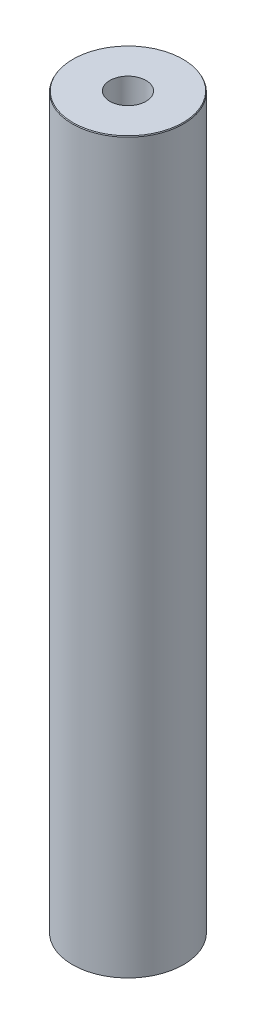
ISO-10303-21;
HEADER;
FILE_DESCRIPTION(('STEP AP214'),'2;1');
FILE_NAME('part.step','',(''),(''),'','','');
FILE_SCHEMA(('AUTOMOTIVE_DESIGN { 1 0 10303 214 1 1 1 1 }'));
ENDSEC;
DATA;
#1=APPLICATION_CONTEXT('core data for automotive mechanical design processes');
#2=APPLICATION_PROTOCOL_DEFINITION('international standard','automotive_design',2000,#1);
#3=PRODUCT_CONTEXT('',#1,'mechanical');
#4=PRODUCT('Part','Part','',(#3));
#5=PRODUCT_RELATED_PRODUCT_CATEGORY('part','',(#4));
#6=PRODUCT_DEFINITION_FORMATION('','',#4);
#7=PRODUCT_DEFINITION_CONTEXT('part definition',#1,'design');
#8=PRODUCT_DEFINITION('design','',#6,#7);
#9=PRODUCT_DEFINITION_SHAPE('','',#8);
#10=(LENGTH_UNIT() NAMED_UNIT(*) SI_UNIT(.MILLI.,.METRE.));
#11=(NAMED_UNIT(*) PLANE_ANGLE_UNIT() SI_UNIT($,.RADIAN.));
#12=(NAMED_UNIT(*) SI_UNIT($,.STERADIAN.) SOLID_ANGLE_UNIT());
#13=UNCERTAINTY_MEASURE_WITH_UNIT(LENGTH_MEASURE(1.E-05),#10,'distance_accuracy_value','');
#14=(GEOMETRIC_REPRESENTATION_CONTEXT(3) GLOBAL_UNCERTAINTY_ASSIGNED_CONTEXT((#13)) GLOBAL_UNIT_ASSIGNED_CONTEXT((#10,
#11,#12)) REPRESENTATION_CONTEXT('',''));
#15=CARTESIAN_POINT('',(0.,0.,0.));
#16=DIRECTION('',(0.,0.,1.));
#17=DIRECTION('',(1.,0.,0.));
#18=AXIS2_PLACEMENT_3D('',#15,#16,#17);
#19=CARTESIAN_POINT('',(0.,394.291483445102,0.));
#20=DIRECTION('',(0.,-1.,0.));
#21=DIRECTION('',(0.,0.,-1.));
#22=AXIS2_PLACEMENT_3D('',#19,#20,#21);
#23=CYLINDRICAL_SURFACE('',#22,30.);
#24=CARTESIAN_POINT('',(0.,393.805479076296,0.));
#25=DIRECTION('',(0.,1.,0.));
#26=DIRECTION('',(0.,0.,1.));
#27=AXIS2_PLACEMENT_3D('',#24,#25,#26);
#28=CIRCLE('',#27,30.);
#29=CARTESIAN_POINT('',(0.,393.805479076296,30.));
#30=VERTEX_POINT('',#29);
#31=EDGE_CURVE('E50',#30,#30,#28,.F.);
#32=ORIENTED_EDGE('',*,*,#31,.T.);
#33=EDGE_LOOP('',(#32));
#34=FACE_BOUND('',#33,.T.);
#35=CARTESIAN_POINT('',(0.,0.28059475315767,0.));
#36=DIRECTION('',(0.,1.,0.));
#37=DIRECTION('',(0.,0.,1.));
#38=AXIS2_PLACEMENT_3D('',#35,#36,#37);
#39=CIRCLE('',#38,30.);
#40=CARTESIAN_POINT('',(0.,0.28059475315767,30.));
#41=VERTEX_POINT('',#40);
#42=EDGE_CURVE('E51',#41,#41,#39,.T.);
#43=ORIENTED_EDGE('',*,*,#42,.T.);
#44=EDGE_LOOP('',(#43));
#45=FACE_BOUND('',#44,.T.);
#46=ADVANCED_FACE('F39',(#34,#45),#23,.T.);
#47=CARTESIAN_POINT('',(0.,394.291483445102,0.));
#48=DIRECTION('',(0.,1.,0.));
#49=DIRECTION('',(0.,0.,1.));
#50=AXIS2_PLACEMENT_3D('',#47,#48,#49);
#51=PLANE('',#50);
#52=CARTESIAN_POINT('',(0.,394.291483445102,0.));
#53=DIRECTION('',(0.,1.,0.));
#54=DIRECTION('',(0.,0.,1.));
#55=AXIS2_PLACEMENT_3D('',#52,#53,#54);
#56=CIRCLE('',#55,29.7194052468423);
#57=CARTESIAN_POINT('',(0.,394.291483445102,29.7194052468423));
#58=VERTEX_POINT('',#57);
#59=EDGE_CURVE('E54',#58,#58,#56,.T.);
#60=ORIENTED_EDGE('',*,*,#59,.T.);
#61=EDGE_LOOP('',(#60));
#62=FACE_BOUND('',#61,.T.);
#63=CARTESIAN_POINT('',(0.,394.291483445102,0.));
#64=DIRECTION('',(0.,1.,0.));
#65=DIRECTION('',(0.,0.,1.));
#66=AXIS2_PLACEMENT_3D('',#63,#64,#65);
#67=CIRCLE('',#66,9.78675789232819);
#68=CARTESIAN_POINT('',(0.,394.291483445102,9.78675789232819));
#69=VERTEX_POINT('',#68);
#70=EDGE_CURVE('E58',#69,#69,#67,.T.);
#71=ORIENTED_EDGE('',*,*,#70,.F.);
#72=EDGE_LOOP('',(#71));
#73=FACE_BOUND('',#72,.T.);
#74=ADVANCED_FACE('F69',(#62,#73),#51,.T.);
#75=CARTESIAN_POINT('',(0.,0.,0.));
#76=DIRECTION('',(0.,1.,0.));
#77=DIRECTION('',(0.,0.,1.));
#78=AXIS2_PLACEMENT_3D('',#75,#76,#77);
#79=PLANE('',#78);
#80=CARTESIAN_POINT('',(0.,0.,0.));
#81=DIRECTION('',(0.,1.,0.));
#82=DIRECTION('',(0.,0.,1.));
#83=AXIS2_PLACEMENT_3D('',#80,#81,#82);
#84=CIRCLE('',#83,29.5139956311936);
#85=CARTESIAN_POINT('',(0.,0.,29.5139956311936));
#86=VERTEX_POINT('',#85);
#87=EDGE_CURVE('E10',#86,#86,#84,.F.);
#88=ORIENTED_EDGE('',*,*,#87,.T.);
#89=EDGE_LOOP('',(#88));
#90=FACE_BOUND('',#89,.T.);
#91=CARTESIAN_POINT('',(0.,0.,0.));
#92=DIRECTION('',(0.,1.,0.));
#93=DIRECTION('',(0.,0.,1.));
#94=AXIS2_PLACEMENT_3D('',#91,#92,#93);
#95=CIRCLE('',#94,9.78675789232819);
#96=CARTESIAN_POINT('',(0.,0.,9.78675789232819));
#97=VERTEX_POINT('',#96);
#98=EDGE_CURVE('E63',#97,#97,#95,.T.);
#99=ORIENTED_EDGE('',*,*,#98,.T.);
#100=EDGE_LOOP('',(#99));
#101=FACE_BOUND('',#100,.T.);
#102=ADVANCED_FACE('F75',(#90,#101),#79,.F.);
#103=CARTESIAN_POINT('',(0.,394.291483445102,0.));
#104=DIRECTION('',(0.,-1.,0.));
#105=DIRECTION('',(0.,0.,-1.));
#106=AXIS2_PLACEMENT_3D('',#103,#104,#105);
#107=CYLINDRICAL_SURFACE('',#106,9.78675789232819);
#108=ORIENTED_EDGE('',*,*,#70,.T.);
#109=EDGE_LOOP('',(#108));
#110=FACE_BOUND('',#109,.T.);
#111=ORIENTED_EDGE('',*,*,#98,.F.);
#112=EDGE_LOOP('',(#111));
#113=FACE_BOUND('',#112,.T.);
#114=ADVANCED_FACE('F70',(#110,#113),#107,.F.);
#115=CARTESIAN_POINT('',(0.,394.291483445102,0.));
#116=DIRECTION('',(0.,-1.,0.));
#117=DIRECTION('',(0.,0.,-1.));
#118=AXIS2_PLACEMENT_3D('',#115,#116,#117);
#119=CONICAL_SURFACE('',#118,29.7194052468423,0.523598775598269);
#120=ORIENTED_EDGE('',*,*,#31,.F.);
#121=EDGE_LOOP('',(#120));
#122=FACE_BOUND('',#121,.T.);
#123=ORIENTED_EDGE('',*,*,#59,.F.);
#124=EDGE_LOOP('',(#123));
#125=FACE_BOUND('',#124,.T.);
#126=ADVANCED_FACE('F81',(#122,#125),#119,.T.);
#127=CARTESIAN_POINT('',(0.,0.28059475315767,0.));
#128=DIRECTION('',(0.,1.,0.));
#129=DIRECTION('',(0.,0.,1.));
#130=AXIS2_PLACEMENT_3D('',#127,#128,#129);
#131=CONICAL_SURFACE('',#130,30.,1.04719755119665);
#132=ORIENTED_EDGE('',*,*,#87,.F.);
#133=EDGE_LOOP('',(#132));
#134=FACE_BOUND('',#133,.T.);
#135=ORIENTED_EDGE('',*,*,#42,.F.);
#136=EDGE_LOOP('',(#135));
#137=FACE_BOUND('',#136,.T.);
#138=ADVANCED_FACE('F45',(#134,#137),#131,.T.);
#139=CLOSED_SHELL('',(#46,#74,#102,#114,#126,#138));
#140=MANIFOLD_SOLID_BREP('B2',#139);
#141=ADVANCED_BREP_SHAPE_REPRESENTATION('',(#18,#140),#14);
#142=SHAPE_DEFINITION_REPRESENTATION(#9,#141);
ENDSEC;
END-ISO-10303-21;
